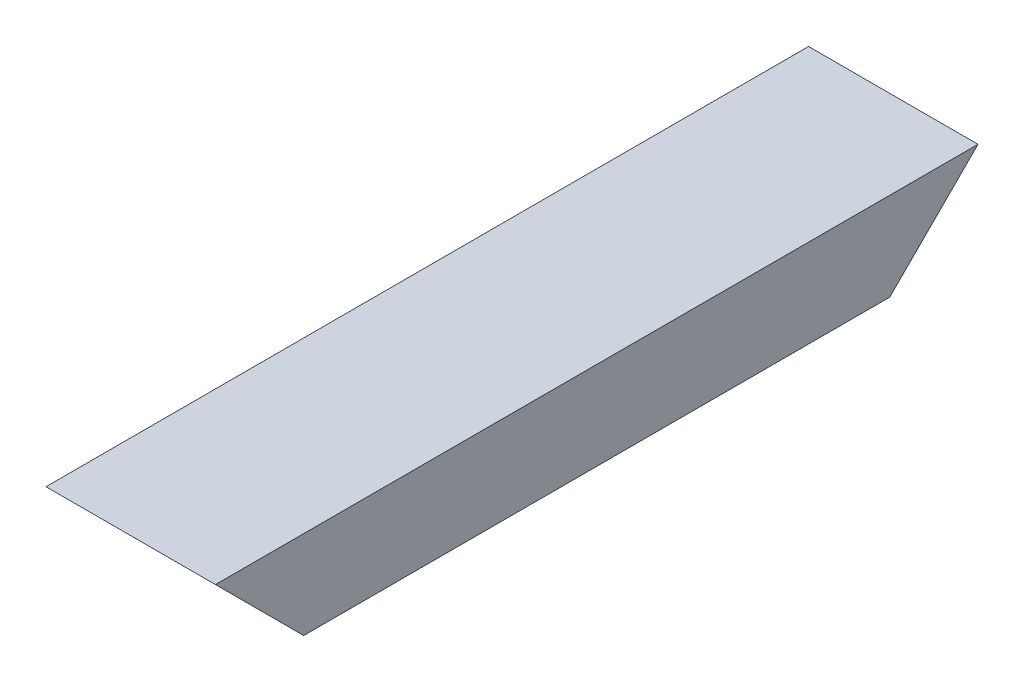
ISO-10303-21;
HEADER;
FILE_DESCRIPTION(('STEP AP214'),'2;1');
FILE_NAME('part.step','',(''),(''),'','','');
FILE_SCHEMA(('AUTOMOTIVE_DESIGN { 1 0 10303 214 1 1 1 1 }'));
ENDSEC;
DATA;
#1=APPLICATION_CONTEXT('core data for automotive mechanical design processes');
#2=APPLICATION_PROTOCOL_DEFINITION('international standard','automotive_design',2000,#1);
#3=PRODUCT_CONTEXT('',#1,'mechanical');
#4=PRODUCT('Part','Part','',(#3));
#5=PRODUCT_RELATED_PRODUCT_CATEGORY('part','',(#4));
#6=PRODUCT_DEFINITION_FORMATION('','',#4);
#7=PRODUCT_DEFINITION_CONTEXT('part definition',#1,'design');
#8=PRODUCT_DEFINITION('design','',#6,#7);
#9=PRODUCT_DEFINITION_SHAPE('','',#8);
#10=(LENGTH_UNIT() NAMED_UNIT(*) SI_UNIT(.MILLI.,.METRE.));
#11=(NAMED_UNIT(*) PLANE_ANGLE_UNIT() SI_UNIT($,.RADIAN.));
#12=(NAMED_UNIT(*) SI_UNIT($,.STERADIAN.) SOLID_ANGLE_UNIT());
#13=UNCERTAINTY_MEASURE_WITH_UNIT(LENGTH_MEASURE(1.E-05),#10,'distance_accuracy_value','');
#14=(GEOMETRIC_REPRESENTATION_CONTEXT(3) GLOBAL_UNCERTAINTY_ASSIGNED_CONTEXT((#13)) GLOBAL_UNIT_ASSIGNED_CONTEXT((#10,
#11,#12)) REPRESENTATION_CONTEXT('',''));
#15=CARTESIAN_POINT('',(0.,0.,0.));
#16=DIRECTION('',(0.,0.,1.));
#17=DIRECTION('',(1.,0.,0.));
#18=AXIS2_PLACEMENT_3D('',#15,#16,#17);
#19=CARTESIAN_POINT('',(57.75,119.,216.));
#20=DIRECTION('',(0.,-1.,0.));
#21=DIRECTION('',(0.,0.,-1.));
#22=AXIS2_PLACEMENT_3D('',#19,#20,#21);
#23=PLANE('',#22);
#24=DIRECTION('',(-1.,0.,0.));
#25=VECTOR('',#24,1.);
#26=CARTESIAN_POINT('',(57.75,119.,0.));
#27=LINE('',#26,#25);
#28=CARTESIAN_POINT('',(105.75,119.,0.));
#29=VERTEX_POINT('',#28);
#30=CARTESIAN_POINT('',(57.75,119.,0.));
#31=VERTEX_POINT('',#30);
#32=EDGE_CURVE('E87',#29,#31,#27,.T.);
#33=ORIENTED_EDGE('',*,*,#32,.T.);
#34=DIRECTION('',(0.,0.,-1.));
#35=VECTOR('',#34,1.);
#36=CARTESIAN_POINT('',(57.75,119.,216.));
#37=LINE('',#36,#35);
#38=CARTESIAN_POINT('',(57.75,119.,216.));
#39=VERTEX_POINT('',#38);
#40=EDGE_CURVE('E11',#39,#31,#37,.T.);
#41=ORIENTED_EDGE('',*,*,#40,.F.);
#42=DIRECTION('',(-1.,0.,0.));
#43=VECTOR('',#42,1.);
#44=CARTESIAN_POINT('',(57.75,119.,216.));
#45=LINE('',#44,#43);
#46=CARTESIAN_POINT('',(105.75,119.,216.));
#47=VERTEX_POINT('',#46);
#48=EDGE_CURVE('E98',#47,#39,#45,.T.);
#49=ORIENTED_EDGE('',*,*,#48,.F.);
#50=DIRECTION('',(0.,0.,-1.));
#51=VECTOR('',#50,1.);
#52=CARTESIAN_POINT('',(105.75,119.,216.));
#53=LINE('',#52,#51);
#54=EDGE_CURVE('E104',#47,#29,#53,.T.);
#55=ORIENTED_EDGE('',*,*,#54,.T.);
#56=EDGE_LOOP('',(#33,#41,#49,#55));
#57=FACE_BOUND('',#56,.T.);
#58=ADVANCED_FACE('F39',(#57),#23,.F.);
#59=CARTESIAN_POINT('',(57.75,102.,216.));
#60=DIRECTION('',(1.,0.,0.));
#61=DIRECTION('',(0.,0.,-1.));
#62=AXIS2_PLACEMENT_3D('',#59,#60,#61);
#63=PLANE('',#62);
#64=ORIENTED_EDGE('',*,*,#40,.T.);
#65=DIRECTION('',(0.,-0.707106781186547,0.707106781186547));
#66=VECTOR('',#65,1.);
#67=CARTESIAN_POINT('',(57.75,119.,0.));
#68=LINE('',#67,#66);
#69=CARTESIAN_POINT('',(57.75,102.,17.));
#70=VERTEX_POINT('',#69);
#71=EDGE_CURVE('E93',#31,#70,#68,.T.);
#72=ORIENTED_EDGE('',*,*,#71,.T.);
#73=DIRECTION('',(0.,0.,-1.));
#74=VECTOR('',#73,1.);
#75=CARTESIAN_POINT('',(57.75,102.,216.));
#76=LINE('',#75,#74);
#77=CARTESIAN_POINT('',(57.75,102.,199.));
#78=VERTEX_POINT('',#77);
#79=EDGE_CURVE('E48',#78,#70,#76,.T.);
#80=ORIENTED_EDGE('',*,*,#79,.F.);
#81=DIRECTION('',(0.,0.707106781186547,0.707106781186547));
#82=VECTOR('',#81,1.);
#83=CARTESIAN_POINT('',(57.75,119.,216.));
#84=LINE('',#83,#82);
#85=EDGE_CURVE('E137',#78,#39,#84,.T.);
#86=ORIENTED_EDGE('',*,*,#85,.T.);
#87=EDGE_LOOP('',(#64,#72,#80,#86));
#88=FACE_BOUND('',#87,.T.);
#89=ADVANCED_FACE('F136',(#88),#63,.F.);
#90=CARTESIAN_POINT('',(80.75,102.,216.));
#91=DIRECTION('',(0.,1.,0.));
#92=DIRECTION('',(0.,0.,1.));
#93=AXIS2_PLACEMENT_3D('',#90,#91,#92);
#94=PLANE('',#93);
#95=ORIENTED_EDGE('',*,*,#79,.T.);
#96=DIRECTION('',(1.,0.,0.));
#97=VECTOR('',#96,1.);
#98=CARTESIAN_POINT('',(80.75,102.,17.));
#99=LINE('',#98,#97);
#100=CARTESIAN_POINT('',(80.75,102.,17.));
#101=VERTEX_POINT('',#100);
#102=EDGE_CURVE('E133',#70,#101,#99,.T.);
#103=ORIENTED_EDGE('',*,*,#102,.T.);
#104=DIRECTION('',(0.,0.,-1.));
#105=VECTOR('',#104,1.);
#106=CARTESIAN_POINT('',(80.75,102.,216.));
#107=LINE('',#106,#105);
#108=CARTESIAN_POINT('',(80.75,102.,199.));
#109=VERTEX_POINT('',#108);
#110=EDGE_CURVE('E122',#109,#101,#107,.T.);
#111=ORIENTED_EDGE('',*,*,#110,.F.);
#112=DIRECTION('',(-1.,0.,0.));
#113=VECTOR('',#112,1.);
#114=CARTESIAN_POINT('',(80.75,102.,199.));
#115=LINE('',#114,#113);
#116=EDGE_CURVE('E99',#109,#78,#115,.T.);
#117=ORIENTED_EDGE('',*,*,#116,.T.);
#118=EDGE_LOOP('',(#95,#103,#111,#117));
#119=FACE_BOUND('',#118,.T.);
#120=ADVANCED_FACE('F131',(#119),#94,.F.);
#121=CARTESIAN_POINT('',(80.75,94.,216.));
#122=DIRECTION('',(1.,0.,0.));
#123=DIRECTION('',(0.,0.,-1.));
#124=AXIS2_PLACEMENT_3D('',#121,#122,#123);
#125=PLANE('',#124);
#126=ORIENTED_EDGE('',*,*,#110,.T.);
#127=DIRECTION('',(0.,-0.707106781186548,0.707106781186548));
#128=VECTOR('',#127,1.);
#129=CARTESIAN_POINT('',(80.75,-1.49999999999996,120.5));
#130=LINE('',#129,#128);
#131=CARTESIAN_POINT('',(80.75,94.,25.));
#132=VERTEX_POINT('',#131);
#133=EDGE_CURVE('E142',#101,#132,#130,.T.);
#134=ORIENTED_EDGE('',*,*,#133,.T.);
#135=DIRECTION('',(0.,0.,-1.));
#136=VECTOR('',#135,1.);
#137=CARTESIAN_POINT('',(80.75,94.,216.));
#138=LINE('',#137,#136);
#139=CARTESIAN_POINT('',(80.75,94.,191.));
#140=VERTEX_POINT('',#139);
#141=EDGE_CURVE('E115',#140,#132,#138,.T.);
#142=ORIENTED_EDGE('',*,*,#141,.F.);
#143=DIRECTION('',(0.,0.707106781186548,0.707106781186548));
#144=VECTOR('',#143,1.);
#145=CARTESIAN_POINT('',(80.75,106.5,203.5));
#146=LINE('',#145,#144);
#147=EDGE_CURVE('E156',#140,#109,#146,.T.);
#148=ORIENTED_EDGE('',*,*,#147,.T.);
#149=EDGE_LOOP('',(#126,#134,#142,#148));
#150=FACE_BOUND('',#149,.T.);
#151=ADVANCED_FACE('F163',(#150),#125,.F.);
#152=CARTESIAN_POINT('',(105.75,94.,216.));
#153=DIRECTION('',(0.,1.,0.));
#154=DIRECTION('',(0.,0.,1.));
#155=AXIS2_PLACEMENT_3D('',#152,#153,#154);
#156=PLANE('',#155);
#157=ORIENTED_EDGE('',*,*,#141,.T.);
#158=DIRECTION('',(1.,0.,0.));
#159=VECTOR('',#158,1.);
#160=CARTESIAN_POINT('',(57.75,94.,25.));
#161=LINE('',#160,#159);
#162=CARTESIAN_POINT('',(105.75,94.,25.));
#163=VERTEX_POINT('',#162);
#164=EDGE_CURVE('E139',#132,#163,#161,.T.);
#165=ORIENTED_EDGE('',*,*,#164,.T.);
#166=DIRECTION('',(0.,0.,-1.));
#167=VECTOR('',#166,1.);
#168=CARTESIAN_POINT('',(105.75,94.,216.));
#169=LINE('',#168,#167);
#170=CARTESIAN_POINT('',(105.75,94.,191.));
#171=VERTEX_POINT('',#170);
#172=EDGE_CURVE('E107',#171,#163,#169,.T.);
#173=ORIENTED_EDGE('',*,*,#172,.F.);
#174=DIRECTION('',(1.,0.,0.));
#175=VECTOR('',#174,1.);
#176=CARTESIAN_POINT('',(57.75,94.,191.));
#177=LINE('',#176,#175);
#178=EDGE_CURVE('E109',#140,#171,#177,.T.);
#179=ORIENTED_EDGE('',*,*,#178,.F.);
#180=EDGE_LOOP('',(#157,#165,#173,#179));
#181=FACE_BOUND('',#180,.T.);
#182=ADVANCED_FACE('F167',(#181),#156,.F.);
#183=CARTESIAN_POINT('',(105.75,119.,216.));
#184=DIRECTION('',(-1.,0.,0.));
#185=DIRECTION('',(0.,0.,1.));
#186=AXIS2_PLACEMENT_3D('',#183,#184,#185);
#187=PLANE('',#186);
#188=ORIENTED_EDGE('',*,*,#172,.T.);
#189=DIRECTION('',(0.,-0.707106781186547,0.707106781186547));
#190=VECTOR('',#189,1.);
#191=CARTESIAN_POINT('',(105.75,119.,0.));
#192=LINE('',#191,#190);
#193=EDGE_CURVE('E90',#29,#163,#192,.T.);
#194=ORIENTED_EDGE('',*,*,#193,.F.);
#195=ORIENTED_EDGE('',*,*,#54,.F.);
#196=DIRECTION('',(0.,0.707106781186547,0.707106781186547));
#197=VECTOR('',#196,1.);
#198=CARTESIAN_POINT('',(105.75,119.,216.));
#199=LINE('',#198,#197);
#200=EDGE_CURVE('E54',#171,#47,#199,.T.);
#201=ORIENTED_EDGE('',*,*,#200,.F.);
#202=EDGE_LOOP('',(#188,#194,#195,#201));
#203=FACE_BOUND('',#202,.T.);
#204=ADVANCED_FACE('F103',(#203),#187,.F.);
#205=CARTESIAN_POINT('',(57.75,119.,0.));
#206=DIRECTION('',(0.,0.707106781186548,0.707106781186548));
#207=DIRECTION('',(0.,-0.707106781186548,0.707106781186548));
#208=AXIS2_PLACEMENT_3D('',#205,#206,#207);
#209=PLANE('',#208);
#210=ORIENTED_EDGE('',*,*,#71,.F.);
#211=ORIENTED_EDGE('',*,*,#32,.F.);
#212=ORIENTED_EDGE('',*,*,#193,.T.);
#213=ORIENTED_EDGE('',*,*,#164,.F.);
#214=ORIENTED_EDGE('',*,*,#133,.F.);
#215=ORIENTED_EDGE('',*,*,#102,.F.);
#216=EDGE_LOOP('',(#210,#211,#212,#213,#214,#215));
#217=FACE_BOUND('',#216,.T.);
#218=ADVANCED_FACE('F89',(#217),#209,.F.);
#219=CARTESIAN_POINT('',(57.75,119.,216.));
#220=DIRECTION('',(0.,0.707106781186548,-0.707106781186548));
#221=DIRECTION('',(0.,0.707106781186548,0.707106781186548));
#222=AXIS2_PLACEMENT_3D('',#219,#220,#221);
#223=PLANE('',#222);
#224=ORIENTED_EDGE('',*,*,#147,.F.);
#225=ORIENTED_EDGE('',*,*,#178,.T.);
#226=ORIENTED_EDGE('',*,*,#200,.T.);
#227=ORIENTED_EDGE('',*,*,#48,.T.);
#228=ORIENTED_EDGE('',*,*,#85,.F.);
#229=ORIENTED_EDGE('',*,*,#116,.F.);
#230=EDGE_LOOP('',(#224,#225,#226,#227,#228,#229));
#231=FACE_BOUND('',#230,.T.);
#232=ADVANCED_FACE('F165',(#231),#223,.F.);
#233=CLOSED_SHELL('',(#58,#89,#120,#151,#182,#204,#218,#232));
#234=MANIFOLD_SOLID_BREP('B2',#233);
#235=ADVANCED_BREP_SHAPE_REPRESENTATION('',(#18,#234),#14);
#236=SHAPE_DEFINITION_REPRESENTATION(#9,#235);
ENDSEC;
END-ISO-10303-21;
